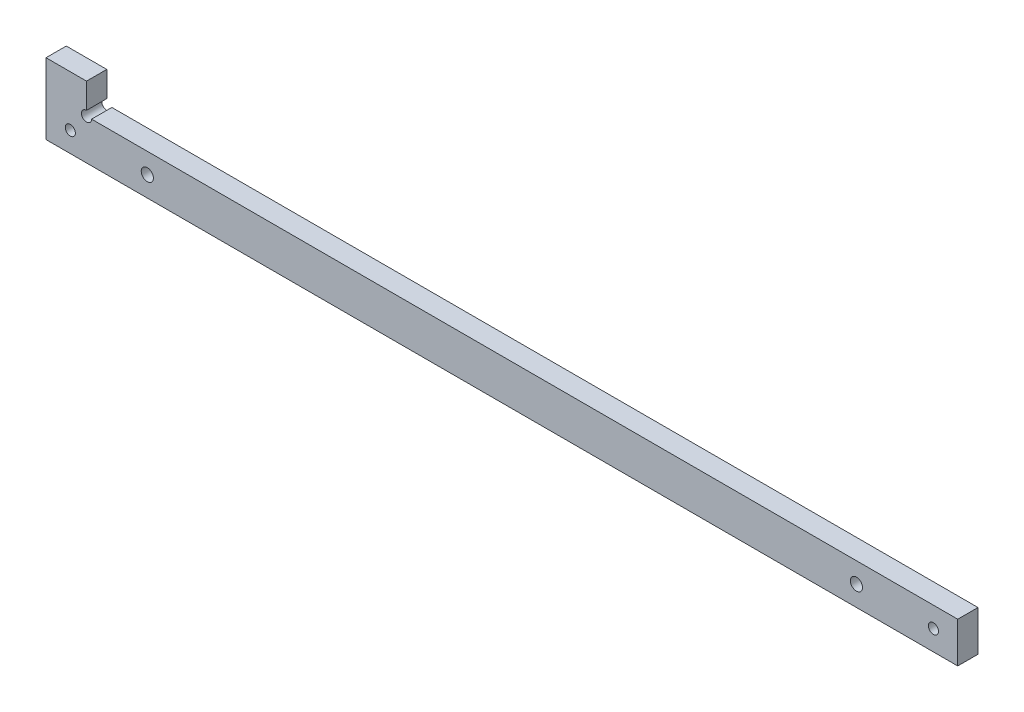
ISO-10303-21;
HEADER;
FILE_DESCRIPTION(('STEP AP214'),'2;1');
FILE_NAME('part.step','',(''),(''),'','','');
FILE_SCHEMA(('AUTOMOTIVE_DESIGN { 1 0 10303 214 1 1 1 1 }'));
ENDSEC;
DATA;
#1=APPLICATION_CONTEXT('core data for automotive mechanical design processes');
#2=APPLICATION_PROTOCOL_DEFINITION('international standard','automotive_design',2000,#1);
#3=PRODUCT_CONTEXT('',#1,'mechanical');
#4=PRODUCT('Part','Part','',(#3));
#5=PRODUCT_RELATED_PRODUCT_CATEGORY('part','',(#4));
#6=PRODUCT_DEFINITION_FORMATION('','',#4);
#7=PRODUCT_DEFINITION_CONTEXT('part definition',#1,'design');
#8=PRODUCT_DEFINITION('design','',#6,#7);
#9=PRODUCT_DEFINITION_SHAPE('','',#8);
#10=(LENGTH_UNIT() NAMED_UNIT(*) SI_UNIT(.MILLI.,.METRE.));
#11=(NAMED_UNIT(*) PLANE_ANGLE_UNIT() SI_UNIT($,.RADIAN.));
#12=(NAMED_UNIT(*) SI_UNIT($,.STERADIAN.) SOLID_ANGLE_UNIT());
#13=UNCERTAINTY_MEASURE_WITH_UNIT(LENGTH_MEASURE(1.E-05),#10,'distance_accuracy_value','');
#14=(GEOMETRIC_REPRESENTATION_CONTEXT(3) GLOBAL_UNCERTAINTY_ASSIGNED_CONTEXT((#13)) GLOBAL_UNIT_ASSIGNED_CONTEXT((#10,
#11,#12)) REPRESENTATION_CONTEXT('',''));
#15=CARTESIAN_POINT('',(0.,0.,0.));
#16=DIRECTION('',(0.,0.,1.));
#17=DIRECTION('',(1.,0.,0.));
#18=AXIS2_PLACEMENT_3D('',#15,#16,#17);
#19=CARTESIAN_POINT('',(-20.,15.,10.));
#20=DIRECTION('',(0.,-1.,0.));
#21=DIRECTION('',(0.,0.,-1.));
#22=AXIS2_PLACEMENT_3D('',#19,#20,#21);
#23=PLANE('',#22);
#24=DIRECTION('',(-1.,0.,0.));
#25=VECTOR('',#24,1.);
#26=CARTESIAN_POINT('',(-20.,15.,0.));
#27=LINE('',#26,#25);
#28=CARTESIAN_POINT('',(0.,15.,0.));
#29=VERTEX_POINT('',#28);
#30=CARTESIAN_POINT('',(-20.,15.,0.));
#31=VERTEX_POINT('',#30);
#32=EDGE_CURVE('E124',#29,#31,#27,.T.);
#33=ORIENTED_EDGE('',*,*,#32,.T.);
#34=DIRECTION('',(0.,0.,-1.));
#35=VECTOR('',#34,1.);
#36=CARTESIAN_POINT('',(-20.,15.,10.));
#37=LINE('',#36,#35);
#38=CARTESIAN_POINT('',(-20.,15.,10.));
#39=VERTEX_POINT('',#38);
#40=EDGE_CURVE('E11',#39,#31,#37,.T.);
#41=ORIENTED_EDGE('',*,*,#40,.F.);
#42=DIRECTION('',(-1.,0.,0.));
#43=VECTOR('',#42,1.);
#44=CARTESIAN_POINT('',(-20.,15.,10.));
#45=LINE('',#44,#43);
#46=CARTESIAN_POINT('',(0.,15.,10.));
#47=VERTEX_POINT('',#46);
#48=EDGE_CURVE('E137',#47,#39,#45,.T.);
#49=ORIENTED_EDGE('',*,*,#48,.F.);
#50=DIRECTION('',(0.,0.,-1.));
#51=VECTOR('',#50,1.);
#52=CARTESIAN_POINT('',(0.,15.,10.));
#53=LINE('',#52,#51);
#54=EDGE_CURVE('E120',#47,#29,#53,.T.);
#55=ORIENTED_EDGE('',*,*,#54,.T.);
#56=EDGE_LOOP('',(#33,#41,#49,#55));
#57=FACE_BOUND('',#56,.T.);
#58=ADVANCED_FACE('F34',(#57),#23,.F.);
#59=CARTESIAN_POINT('',(-20.,-20.,10.));
#60=DIRECTION('',(1.,0.,0.));
#61=DIRECTION('',(0.,1.,0.));
#62=AXIS2_PLACEMENT_3D('',#59,#60,#61);
#63=PLANE('',#62);
#64=DIRECTION('',(0.,-1.,0.));
#65=VECTOR('',#64,1.);
#66=CARTESIAN_POINT('',(-20.,-20.,0.));
#67=LINE('',#66,#65);
#68=CARTESIAN_POINT('',(-20.,-20.,0.));
#69=VERTEX_POINT('',#68);
#70=EDGE_CURVE('E127',#31,#69,#67,.T.);
#71=ORIENTED_EDGE('',*,*,#70,.T.);
#72=DIRECTION('',(0.,0.,-1.));
#73=VECTOR('',#72,1.);
#74=CARTESIAN_POINT('',(-20.,-20.,10.));
#75=LINE('',#74,#73);
#76=CARTESIAN_POINT('',(-20.,-20.,10.));
#77=VERTEX_POINT('',#76);
#78=EDGE_CURVE('E42',#77,#69,#75,.T.);
#79=ORIENTED_EDGE('',*,*,#78,.F.);
#80=DIRECTION('',(0.,-1.,0.));
#81=VECTOR('',#80,1.);
#82=CARTESIAN_POINT('',(-20.,-20.,10.));
#83=LINE('',#82,#81);
#84=EDGE_CURVE('E90',#39,#77,#83,.T.);
#85=ORIENTED_EDGE('',*,*,#84,.F.);
#86=ORIENTED_EDGE('',*,*,#40,.T.);
#87=EDGE_LOOP('',(#71,#79,#85,#86));
#88=FACE_BOUND('',#87,.T.);
#89=ADVANCED_FACE('F212',(#88),#63,.F.);
#90=CARTESIAN_POINT('',(430.,-20.,10.));
#91=DIRECTION('',(0.,1.,0.));
#92=DIRECTION('',(-1.,0.,0.));
#93=AXIS2_PLACEMENT_3D('',#90,#91,#92);
#94=PLANE('',#93);
#95=DIRECTION('',(1.,0.,0.));
#96=VECTOR('',#95,1.);
#97=CARTESIAN_POINT('',(430.,-20.,0.));
#98=LINE('',#97,#96);
#99=CARTESIAN_POINT('',(430.,-20.,0.));
#100=VERTEX_POINT('',#99);
#101=EDGE_CURVE('E130',#69,#100,#98,.T.);
#102=ORIENTED_EDGE('',*,*,#101,.T.);
#103=DIRECTION('',(0.,0.,-1.));
#104=VECTOR('',#103,1.);
#105=CARTESIAN_POINT('',(430.,-20.,10.));
#106=LINE('',#105,#104);
#107=CARTESIAN_POINT('',(430.,-20.,10.));
#108=VERTEX_POINT('',#107);
#109=EDGE_CURVE('E141',#108,#100,#106,.T.);
#110=ORIENTED_EDGE('',*,*,#109,.F.);
#111=DIRECTION('',(1.,0.,0.));
#112=VECTOR('',#111,1.);
#113=CARTESIAN_POINT('',(430.,-20.,10.));
#114=LINE('',#113,#112);
#115=EDGE_CURVE('E149',#77,#108,#114,.T.);
#116=ORIENTED_EDGE('',*,*,#115,.F.);
#117=ORIENTED_EDGE('',*,*,#78,.T.);
#118=EDGE_LOOP('',(#102,#110,#116,#117));
#119=FACE_BOUND('',#118,.T.);
#120=ADVANCED_FACE('F147',(#119),#94,.F.);
#121=CARTESIAN_POINT('',(430.,0.,10.));
#122=DIRECTION('',(-1.,0.,0.));
#123=DIRECTION('',(0.,0.,1.));
#124=AXIS2_PLACEMENT_3D('',#121,#122,#123);
#125=PLANE('',#124);
#126=DIRECTION('',(0.,1.,0.));
#127=VECTOR('',#126,1.);
#128=CARTESIAN_POINT('',(430.,0.,0.));
#129=LINE('',#128,#127);
#130=CARTESIAN_POINT('',(430.,0.,0.));
#131=VERTEX_POINT('',#130);
#132=EDGE_CURVE('E132',#100,#131,#129,.T.);
#133=ORIENTED_EDGE('',*,*,#132,.T.);
#134=DIRECTION('',(0.,0.,-1.));
#135=VECTOR('',#134,1.);
#136=CARTESIAN_POINT('',(430.,0.,10.));
#137=LINE('',#136,#135);
#138=CARTESIAN_POINT('',(430.,0.,10.));
#139=VERTEX_POINT('',#138);
#140=EDGE_CURVE('E115',#139,#131,#137,.T.);
#141=ORIENTED_EDGE('',*,*,#140,.F.);
#142=DIRECTION('',(0.,1.,0.));
#143=VECTOR('',#142,1.);
#144=CARTESIAN_POINT('',(430.,0.,10.));
#145=LINE('',#144,#143);
#146=EDGE_CURVE('E106',#108,#139,#145,.T.);
#147=ORIENTED_EDGE('',*,*,#146,.F.);
#148=ORIENTED_EDGE('',*,*,#109,.T.);
#149=EDGE_LOOP('',(#133,#141,#147,#148));
#150=FACE_BOUND('',#149,.T.);
#151=ADVANCED_FACE('F155',(#150),#125,.F.);
#152=CARTESIAN_POINT('',(2.5,0.,10.));
#153=DIRECTION('',(0.,-1.,0.));
#154=DIRECTION('',(0.,0.,-1.));
#155=AXIS2_PLACEMENT_3D('',#152,#153,#154);
#156=PLANE('',#155);
#157=DIRECTION('',(-1.,0.,0.));
#158=VECTOR('',#157,1.);
#159=CARTESIAN_POINT('',(2.5,0.,0.));
#160=LINE('',#159,#158);
#161=CARTESIAN_POINT('',(2.5,0.,0.));
#162=VERTEX_POINT('',#161);
#163=EDGE_CURVE('E114',#131,#162,#160,.T.);
#164=ORIENTED_EDGE('',*,*,#163,.T.);
#165=DIRECTION('',(0.,0.,-1.));
#166=VECTOR('',#165,1.);
#167=CARTESIAN_POINT('',(2.5,0.,10.));
#168=LINE('',#167,#166);
#169=CARTESIAN_POINT('',(2.5,0.,10.));
#170=VERTEX_POINT('',#169);
#171=EDGE_CURVE('E111',#170,#162,#168,.T.);
#172=ORIENTED_EDGE('',*,*,#171,.F.);
#173=DIRECTION('',(-1.,0.,0.));
#174=VECTOR('',#173,1.);
#175=CARTESIAN_POINT('',(2.5,0.,10.));
#176=LINE('',#175,#174);
#177=EDGE_CURVE('E100',#139,#170,#176,.T.);
#178=ORIENTED_EDGE('',*,*,#177,.F.);
#179=ORIENTED_EDGE('',*,*,#140,.T.);
#180=EDGE_LOOP('',(#164,#172,#178,#179));
#181=FACE_BOUND('',#180,.T.);
#182=ADVANCED_FACE('F112',(#181),#156,.F.);
#183=CARTESIAN_POINT('',(0.,0.,10.));
#184=DIRECTION('',(0.,0.,-1.));
#185=DIRECTION('',(-1.,0.,0.));
#186=AXIS2_PLACEMENT_3D('',#183,#184,#185);
#187=CYLINDRICAL_SURFACE('',#186,2.5);
#188=CARTESIAN_POINT('',(0.,0.,0.));
#189=DIRECTION('',(0.,0.,-1.));
#190=DIRECTION('',(1.,0.,0.));
#191=AXIS2_PLACEMENT_3D('',#188,#189,#190);
#192=CIRCLE('',#191,2.5);
#193=CARTESIAN_POINT('',(0.,2.5,0.));
#194=VERTEX_POINT('',#193);
#195=EDGE_CURVE('E76',#162,#194,#192,.T.);
#196=ORIENTED_EDGE('',*,*,#195,.T.);
#197=DIRECTION('',(0.,0.,-1.));
#198=VECTOR('',#197,1.);
#199=CARTESIAN_POINT('',(0.,2.5,10.));
#200=LINE('',#199,#198);
#201=CARTESIAN_POINT('',(0.,2.5,10.));
#202=VERTEX_POINT('',#201);
#203=EDGE_CURVE('E116',#202,#194,#200,.T.);
#204=ORIENTED_EDGE('',*,*,#203,.F.);
#205=CARTESIAN_POINT('',(0.,0.,10.));
#206=DIRECTION('',(0.,0.,-1.));
#207=DIRECTION('',(1.,0.,0.));
#208=AXIS2_PLACEMENT_3D('',#205,#206,#207);
#209=CIRCLE('',#208,2.5);
#210=EDGE_CURVE('E104',#170,#202,#209,.T.);
#211=ORIENTED_EDGE('',*,*,#210,.F.);
#212=ORIENTED_EDGE('',*,*,#171,.T.);
#213=EDGE_LOOP('',(#196,#204,#211,#212));
#214=FACE_BOUND('',#213,.T.);
#215=ADVANCED_FACE('F118',(#214),#187,.F.);
#216=CARTESIAN_POINT('',(0.,15.,10.));
#217=DIRECTION('',(-1.,0.,0.));
#218=DIRECTION('',(0.,-1.,0.));
#219=AXIS2_PLACEMENT_3D('',#216,#217,#218);
#220=PLANE('',#219);
#221=DIRECTION('',(0.,1.,0.));
#222=VECTOR('',#221,1.);
#223=CARTESIAN_POINT('',(0.,15.,0.));
#224=LINE('',#223,#222);
#225=EDGE_CURVE('E82',#194,#29,#224,.T.);
#226=ORIENTED_EDGE('',*,*,#225,.T.);
#227=ORIENTED_EDGE('',*,*,#54,.F.);
#228=DIRECTION('',(0.,1.,0.));
#229=VECTOR('',#228,1.);
#230=CARTESIAN_POINT('',(0.,15.,10.));
#231=LINE('',#230,#229);
#232=EDGE_CURVE('E50',#202,#47,#231,.T.);
#233=ORIENTED_EDGE('',*,*,#232,.F.);
#234=ORIENTED_EDGE('',*,*,#203,.T.);
#235=EDGE_LOOP('',(#226,#227,#233,#234));
#236=FACE_BOUND('',#235,.T.);
#237=ADVANCED_FACE('F196',(#236),#220,.F.);
#238=CARTESIAN_POINT('',(0.,0.,10.));
#239=DIRECTION('',(0.,0.,1.));
#240=DIRECTION('',(1.,0.,0.));
#241=AXIS2_PLACEMENT_3D('',#238,#239,#240);
#242=PLANE('',#241);
#243=CARTESIAN_POINT('',(418.,-9.99999999999995,10.));
#244=DIRECTION('',(0.,0.,1.));
#245=DIRECTION('',(1.,0.,0.));
#246=AXIS2_PLACEMENT_3D('',#243,#244,#245);
#247=CIRCLE('',#246,2.50000000000002);
#248=CARTESIAN_POINT('',(420.5,-9.99999999999995,10.));
#249=VERTEX_POINT('',#248);
#250=EDGE_CURVE('E166',#249,#249,#247,.T.);
#251=ORIENTED_EDGE('',*,*,#250,.F.);
#252=EDGE_LOOP('',(#251));
#253=FACE_BOUND('',#252,.T.);
#254=CARTESIAN_POINT('',(-8.,-10.,10.));
#255=DIRECTION('',(0.,0.,1.));
#256=DIRECTION('',(1.,0.,0.));
#257=AXIS2_PLACEMENT_3D('',#254,#255,#256);
#258=CIRCLE('',#257,2.5);
#259=CARTESIAN_POINT('',(-5.5,-10.,10.));
#260=VERTEX_POINT('',#259);
#261=EDGE_CURVE('E172',#260,#260,#258,.T.);
#262=ORIENTED_EDGE('',*,*,#261,.F.);
#263=EDGE_LOOP('',(#262));
#264=FACE_BOUND('',#263,.T.);
#265=CARTESIAN_POINT('',(380.,-9.99999999999996,10.));
#266=DIRECTION('',(0.,0.,1.));
#267=DIRECTION('',(1.,0.,0.));
#268=AXIS2_PLACEMENT_3D('',#265,#266,#267);
#269=CIRCLE('',#268,2.99999999999999);
#270=CARTESIAN_POINT('',(383.,-9.99999999999996,10.));
#271=VERTEX_POINT('',#270);
#272=EDGE_CURVE('E178',#271,#271,#269,.T.);
#273=ORIENTED_EDGE('',*,*,#272,.F.);
#274=EDGE_LOOP('',(#273));
#275=FACE_BOUND('',#274,.T.);
#276=CARTESIAN_POINT('',(30.,-10.,10.));
#277=DIRECTION('',(0.,0.,1.));
#278=DIRECTION('',(1.,0.,0.));
#279=AXIS2_PLACEMENT_3D('',#276,#277,#278);
#280=CIRCLE('',#279,3.);
#281=CARTESIAN_POINT('',(33.,-10.,10.));
#282=VERTEX_POINT('',#281);
#283=EDGE_CURVE('E160',#282,#282,#280,.T.);
#284=ORIENTED_EDGE('',*,*,#283,.F.);
#285=EDGE_LOOP('',(#284));
#286=FACE_BOUND('',#285,.T.);
#287=ORIENTED_EDGE('',*,*,#48,.T.);
#288=ORIENTED_EDGE('',*,*,#84,.T.);
#289=ORIENTED_EDGE('',*,*,#115,.T.);
#290=ORIENTED_EDGE('',*,*,#146,.T.);
#291=ORIENTED_EDGE('',*,*,#177,.T.);
#292=ORIENTED_EDGE('',*,*,#210,.T.);
#293=ORIENTED_EDGE('',*,*,#232,.T.);
#294=EDGE_LOOP('',(#287,#288,#289,#290,#291,#292,#293));
#295=FACE_BOUND('',#294,.T.);
#296=ADVANCED_FACE('F102',(#253,#264,#275,#286,#295),#242,.T.);
#297=CARTESIAN_POINT('',(0.,0.,0.));
#298=DIRECTION('',(0.,0.,1.));
#299=DIRECTION('',(1.,0.,0.));
#300=AXIS2_PLACEMENT_3D('',#297,#298,#299);
#301=PLANE('',#300);
#302=CARTESIAN_POINT('',(418.,-9.99999999999995,0.));
#303=DIRECTION('',(0.,0.,1.));
#304=DIRECTION('',(1.,0.,0.));
#305=AXIS2_PLACEMENT_3D('',#302,#303,#304);
#306=CIRCLE('',#305,2.50000000000002);
#307=CARTESIAN_POINT('',(420.5,-9.99999999999995,0.));
#308=VERTEX_POINT('',#307);
#309=EDGE_CURVE('E169',#308,#308,#306,.T.);
#310=ORIENTED_EDGE('',*,*,#309,.T.);
#311=EDGE_LOOP('',(#310));
#312=FACE_BOUND('',#311,.T.);
#313=CARTESIAN_POINT('',(-8.,-10.,0.));
#314=DIRECTION('',(0.,0.,1.));
#315=DIRECTION('',(1.,0.,0.));
#316=AXIS2_PLACEMENT_3D('',#313,#314,#315);
#317=CIRCLE('',#316,2.5);
#318=CARTESIAN_POINT('',(-5.5,-10.,0.));
#319=VERTEX_POINT('',#318);
#320=EDGE_CURVE('E175',#319,#319,#317,.T.);
#321=ORIENTED_EDGE('',*,*,#320,.T.);
#322=EDGE_LOOP('',(#321));
#323=FACE_BOUND('',#322,.T.);
#324=CARTESIAN_POINT('',(380.,-9.99999999999996,0.));
#325=DIRECTION('',(0.,0.,1.));
#326=DIRECTION('',(1.,0.,0.));
#327=AXIS2_PLACEMENT_3D('',#324,#325,#326);
#328=CIRCLE('',#327,2.99999999999999);
#329=CARTESIAN_POINT('',(383.,-9.99999999999996,0.));
#330=VERTEX_POINT('',#329);
#331=EDGE_CURVE('E163',#330,#330,#328,.T.);
#332=ORIENTED_EDGE('',*,*,#331,.T.);
#333=EDGE_LOOP('',(#332));
#334=FACE_BOUND('',#333,.T.);
#335=CARTESIAN_POINT('',(30.,-10.,0.));
#336=DIRECTION('',(0.,0.,1.));
#337=DIRECTION('',(1.,0.,0.));
#338=AXIS2_PLACEMENT_3D('',#335,#336,#337);
#339=CIRCLE('',#338,3.);
#340=CARTESIAN_POINT('',(33.,-10.,0.));
#341=VERTEX_POINT('',#340);
#342=EDGE_CURVE('E128',#341,#341,#339,.T.);
#343=ORIENTED_EDGE('',*,*,#342,.T.);
#344=EDGE_LOOP('',(#343));
#345=FACE_BOUND('',#344,.T.);
#346=ORIENTED_EDGE('',*,*,#32,.F.);
#347=ORIENTED_EDGE('',*,*,#225,.F.);
#348=ORIENTED_EDGE('',*,*,#195,.F.);
#349=ORIENTED_EDGE('',*,*,#163,.F.);
#350=ORIENTED_EDGE('',*,*,#132,.F.);
#351=ORIENTED_EDGE('',*,*,#101,.F.);
#352=ORIENTED_EDGE('',*,*,#70,.F.);
#353=EDGE_LOOP('',(#346,#347,#348,#349,#350,#351,#352));
#354=FACE_BOUND('',#353,.T.);
#355=ADVANCED_FACE('F153',(#312,#323,#334,#345,#354),#301,.F.);
#356=CARTESIAN_POINT('',(30.,-10.,0.));
#357=DIRECTION('',(0.,0.,1.));
#358=DIRECTION('',(1.,0.,0.));
#359=AXIS2_PLACEMENT_3D('',#356,#357,#358);
#360=CYLINDRICAL_SURFACE('',#359,3.);
#361=ORIENTED_EDGE('',*,*,#342,.F.);
#362=EDGE_LOOP('',(#361));
#363=FACE_BOUND('',#362,.T.);
#364=ORIENTED_EDGE('',*,*,#283,.T.);
#365=EDGE_LOOP('',(#364));
#366=FACE_BOUND('',#365,.T.);
#367=ADVANCED_FACE('F190',(#363,#366),#360,.F.);
#368=CARTESIAN_POINT('',(380.,-9.99999999999996,0.));
#369=DIRECTION('',(0.,0.,1.));
#370=DIRECTION('',(1.,0.,0.));
#371=AXIS2_PLACEMENT_3D('',#368,#369,#370);
#372=CYLINDRICAL_SURFACE('',#371,2.99999999999999);
#373=ORIENTED_EDGE('',*,*,#331,.F.);
#374=EDGE_LOOP('',(#373));
#375=FACE_BOUND('',#374,.T.);
#376=ORIENTED_EDGE('',*,*,#272,.T.);
#377=EDGE_LOOP('',(#376));
#378=FACE_BOUND('',#377,.T.);
#379=ADVANCED_FACE('F186',(#375,#378),#372,.F.);
#380=CARTESIAN_POINT('',(-8.,-10.,0.));
#381=DIRECTION('',(0.,0.,1.));
#382=DIRECTION('',(1.,0.,0.));
#383=AXIS2_PLACEMENT_3D('',#380,#381,#382);
#384=CYLINDRICAL_SURFACE('',#383,2.5);
#385=ORIENTED_EDGE('',*,*,#320,.F.);
#386=EDGE_LOOP('',(#385));
#387=FACE_BOUND('',#386,.T.);
#388=ORIENTED_EDGE('',*,*,#261,.T.);
#389=EDGE_LOOP('',(#388));
#390=FACE_BOUND('',#389,.T.);
#391=ADVANCED_FACE('F189',(#387,#390),#384,.F.);
#392=CARTESIAN_POINT('',(418.,-9.99999999999995,0.));
#393=DIRECTION('',(0.,0.,1.));
#394=DIRECTION('',(1.,0.,0.));
#395=AXIS2_PLACEMENT_3D('',#392,#393,#394);
#396=CYLINDRICAL_SURFACE('',#395,2.50000000000002);
#397=ORIENTED_EDGE('',*,*,#309,.F.);
#398=EDGE_LOOP('',(#397));
#399=FACE_BOUND('',#398,.T.);
#400=ORIENTED_EDGE('',*,*,#250,.T.);
#401=EDGE_LOOP('',(#400));
#402=FACE_BOUND('',#401,.T.);
#403=ADVANCED_FACE('F282',(#399,#402),#396,.F.);
#404=CLOSED_SHELL('',(#58,#89,#120,#151,#182,#215,#237,#296,#355,#367,#379,#391,#403));
#405=MANIFOLD_SOLID_BREP('B2',#404);
#406=ADVANCED_BREP_SHAPE_REPRESENTATION('',(#18,#405),#14);
#407=SHAPE_DEFINITION_REPRESENTATION(#9,#406);
ENDSEC;
END-ISO-10303-21;
